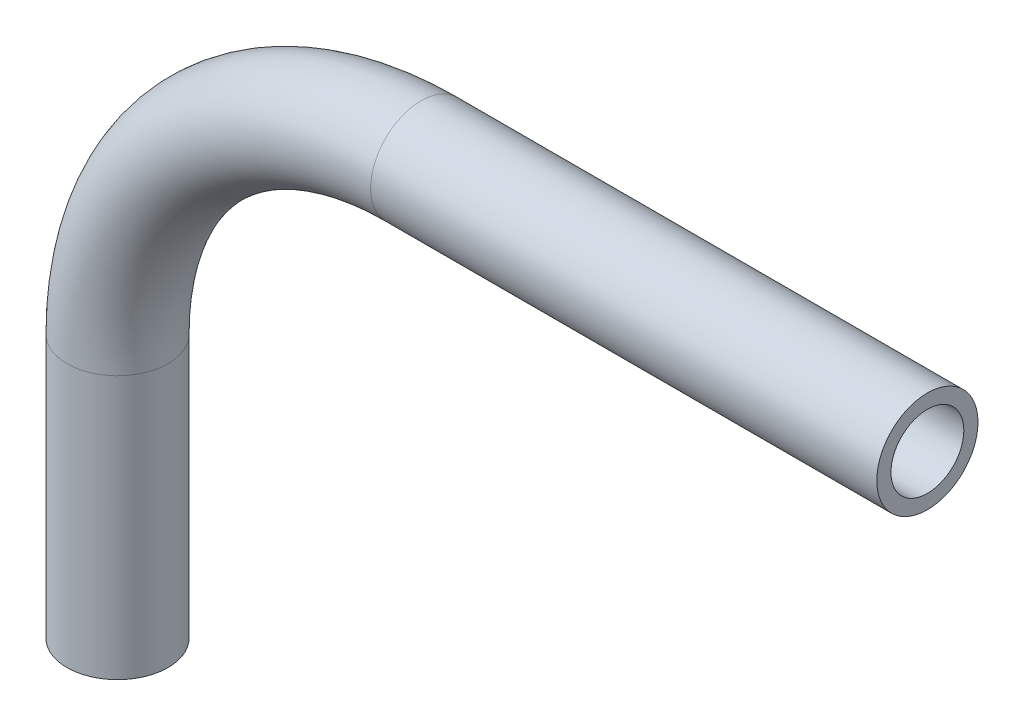
ISO-10303-21;
HEADER;
FILE_DESCRIPTION(('STEP AP214'),'2;1');
FILE_NAME('part.step','',(''),(''),'','','');
FILE_SCHEMA(('AUTOMOTIVE_DESIGN { 1 0 10303 214 1 1 1 1 }'));
ENDSEC;
DATA;
#1=APPLICATION_CONTEXT('core data for automotive mechanical design processes');
#2=APPLICATION_PROTOCOL_DEFINITION('international standard','automotive_design',2000,#1);
#3=PRODUCT_CONTEXT('',#1,'mechanical');
#4=PRODUCT('Part','Part','',(#3));
#5=PRODUCT_RELATED_PRODUCT_CATEGORY('part','',(#4));
#6=PRODUCT_DEFINITION_FORMATION('','',#4);
#7=PRODUCT_DEFINITION_CONTEXT('part definition',#1,'design');
#8=PRODUCT_DEFINITION('design','',#6,#7);
#9=PRODUCT_DEFINITION_SHAPE('','',#8);
#10=(LENGTH_UNIT() NAMED_UNIT(*) SI_UNIT(.MILLI.,.METRE.));
#11=(NAMED_UNIT(*) PLANE_ANGLE_UNIT() SI_UNIT($,.RADIAN.));
#12=(NAMED_UNIT(*) SI_UNIT($,.STERADIAN.) SOLID_ANGLE_UNIT());
#13=UNCERTAINTY_MEASURE_WITH_UNIT(LENGTH_MEASURE(1.E-05),#10,'distance_accuracy_value','');
#14=(GEOMETRIC_REPRESENTATION_CONTEXT(3) GLOBAL_UNCERTAINTY_ASSIGNED_CONTEXT((#13)) GLOBAL_UNIT_ASSIGNED_CONTEXT((#10,
#11,#12)) REPRESENTATION_CONTEXT('',''));
#15=CARTESIAN_POINT('',(0.,0.,0.));
#16=DIRECTION('',(0.,0.,1.));
#17=DIRECTION('',(1.,0.,0.));
#18=AXIS2_PLACEMENT_3D('',#15,#16,#17);
#19=CARTESIAN_POINT('',(0.,-18.0323178807947,0.));
#20=DIRECTION('',(0.,1.,0.));
#21=DIRECTION('',(0.,0.,1.));
#22=AXIS2_PLACEMENT_3D('',#19,#20,#21);
#23=CYLINDRICAL_SURFACE('',#22,3.175);
#24=CARTESIAN_POINT('',(0.,-1.52231788079484,0.));
#25=DIRECTION('',(0.,1.,0.));
#26=DIRECTION('',(0.,0.,-1.));
#27=AXIS2_PLACEMENT_3D('',#24,#25,#26);
#28=CIRCLE('',#27,3.175);
#29=CARTESIAN_POINT('',(-3.175,-1.52231788079487,0.));
#30=VERTEX_POINT('',#29);
#31=EDGE_CURVE('E80',#30,#30,#28,.T.);
#32=ORIENTED_EDGE('',*,*,#31,.F.);
#33=EDGE_LOOP('',(#32));
#34=FACE_BOUND('',#33,.T.);
#35=CARTESIAN_POINT('',(0.,-18.0323178807947,0.));
#36=DIRECTION('',(0.,1.,0.));
#37=DIRECTION('',(0.,0.,-1.));
#38=AXIS2_PLACEMENT_3D('',#35,#36,#37);
#39=CIRCLE('',#38,3.175);
#40=CARTESIAN_POINT('',(0.,-18.0323178807947,-3.175));
#41=VERTEX_POINT('',#40);
#42=EDGE_CURVE('E49',#41,#41,#39,.T.);
#43=ORIENTED_EDGE('',*,*,#42,.T.);
#44=EDGE_LOOP('',(#43));
#45=FACE_BOUND('',#44,.T.);
#46=ADVANCED_FACE('F34',(#34,#45),#23,.T.);
#47=CARTESIAN_POINT('',(19.05,-1.52231788079469,0.));
#48=DIRECTION('',(0.,0.,-1.));
#49=DIRECTION('',(-1.,0.,0.));
#50=AXIS2_PLACEMENT_3D('',#47,#48,#49);
#51=TOROIDAL_SURFACE('',#50,19.05,3.175);
#52=CARTESIAN_POINT('',(19.05,17.5276821192057,0.));
#53=DIRECTION('',(1.,0.,0.));
#54=DIRECTION('',(0.,0.,-1.));
#55=AXIS2_PLACEMENT_3D('',#52,#53,#54);
#56=CIRCLE('',#55,3.175);
#57=CARTESIAN_POINT('',(19.05,20.7026821192053,0.));
#58=VERTEX_POINT('',#57);
#59=EDGE_CURVE('E38',#58,#58,#56,.T.);
#60=CARTESIAN_POINT('',(19.05,-1.52231788079469,0.));
#61=DIRECTION('',(0.,0.,-1.));
#62=DIRECTION('',(-1.,0.,0.));
#63=AXIS2_PLACEMENT_3D('',#60,#61,#62);
#64=CIRCLE('',#63,22.225);
#65=EDGE_CURVE('',#30,#58,#64,.T.);
#66=ORIENTED_EDGE('',*,*,#31,.T.);
#67=ORIENTED_EDGE('',*,*,#59,.F.);
#68=ORIENTED_EDGE('',*,*,#65,.T.);
#69=ORIENTED_EDGE('',*,*,#65,.F.);
#70=EDGE_LOOP('',(#66,#68,#67,#69));
#71=FACE_BOUND('',#70,.T.);
#72=ADVANCED_FACE('F88',(#71),#51,.T.);
#73=CARTESIAN_POINT('',(19.0500000000001,17.5276821192053,0.));
#74=DIRECTION('',(1.,0.,0.));
#75=DIRECTION('',(0.,1.,0.));
#76=AXIS2_PLACEMENT_3D('',#73,#74,#75);
#77=CYLINDRICAL_SURFACE('',#76,3.175);
#78=CARTESIAN_POINT('',(50.8,17.5276821192053,0.));
#79=DIRECTION('',(1.,0.,0.));
#80=DIRECTION('',(0.,0.,-1.));
#81=AXIS2_PLACEMENT_3D('',#78,#79,#80);
#82=CIRCLE('',#81,3.175);
#83=CARTESIAN_POINT('',(50.8,17.5276821192053,-3.175));
#84=VERTEX_POINT('',#83);
#85=EDGE_CURVE('E54',#84,#84,#82,.T.);
#86=ORIENTED_EDGE('',*,*,#85,.F.);
#87=EDGE_LOOP('',(#86));
#88=FACE_BOUND('',#87,.T.);
#89=ORIENTED_EDGE('',*,*,#59,.T.);
#90=EDGE_LOOP('',(#89));
#91=FACE_BOUND('',#90,.T.);
#92=ADVANCED_FACE('F36',(#88,#91),#77,.T.);
#93=CARTESIAN_POINT('',(0.,-18.0323178807947,0.));
#94=DIRECTION('',(0.,1.,0.));
#95=DIRECTION('',(0.,0.,-1.));
#96=AXIS2_PLACEMENT_3D('',#93,#94,#95);
#97=PLANE('',#96);
#98=CARTESIAN_POINT('',(0.,-18.0323178807947,0.));
#99=DIRECTION('',(0.,1.,0.));
#100=DIRECTION('',(0.,0.,-1.));
#101=AXIS2_PLACEMENT_3D('',#98,#99,#100);
#102=CIRCLE('',#101,2.286);
#103=CARTESIAN_POINT('',(0.,-18.0323178807947,-2.286));
#104=VERTEX_POINT('',#103);
#105=EDGE_CURVE('E75',#104,#104,#102,.F.);
#106=ORIENTED_EDGE('',*,*,#105,.F.);
#107=EDGE_LOOP('',(#106));
#108=FACE_BOUND('',#107,.T.);
#109=ORIENTED_EDGE('',*,*,#42,.F.);
#110=EDGE_LOOP('',(#109));
#111=FACE_BOUND('',#110,.T.);
#112=ADVANCED_FACE('F94',(#108,#111),#97,.F.);
#113=CARTESIAN_POINT('',(50.8,17.5276821192053,0.));
#114=DIRECTION('',(1.,0.,0.));
#115=DIRECTION('',(0.,0.,-1.));
#116=AXIS2_PLACEMENT_3D('',#113,#114,#115);
#117=PLANE('',#116);
#118=CARTESIAN_POINT('',(50.8,17.5276821192053,0.));
#119=DIRECTION('',(1.,0.,0.));
#120=DIRECTION('',(0.,0.,-1.));
#121=AXIS2_PLACEMENT_3D('',#118,#119,#120);
#122=CIRCLE('',#121,2.286);
#123=CARTESIAN_POINT('',(50.8,17.5276821192053,-2.286));
#124=VERTEX_POINT('',#123);
#125=EDGE_CURVE('E11',#124,#124,#122,.F.);
#126=ORIENTED_EDGE('',*,*,#125,.T.);
#127=EDGE_LOOP('',(#126));
#128=FACE_BOUND('',#127,.T.);
#129=ORIENTED_EDGE('',*,*,#85,.T.);
#130=EDGE_LOOP('',(#129));
#131=FACE_BOUND('',#130,.T.);
#132=ADVANCED_FACE('F61',(#128,#131),#117,.T.);
#133=CARTESIAN_POINT('',(0.,-18.0323178807947,0.));
#134=DIRECTION('',(0.,1.,0.));
#135=DIRECTION('',(0.,0.,1.));
#136=AXIS2_PLACEMENT_3D('',#133,#134,#135);
#137=CYLINDRICAL_SURFACE('',#136,2.286);
#138=CARTESIAN_POINT('',(0.,-1.52231788079484,0.));
#139=DIRECTION('',(0.,1.,0.));
#140=DIRECTION('',(0.,0.,-1.));
#141=AXIS2_PLACEMENT_3D('',#138,#139,#140);
#142=CIRCLE('',#141,2.286);
#143=CARTESIAN_POINT('',(-2.286,-1.52231788079486,0.));
#144=VERTEX_POINT('',#143);
#145=EDGE_CURVE('E72',#144,#144,#142,.F.);
#146=ORIENTED_EDGE('',*,*,#145,.F.);
#147=EDGE_LOOP('',(#146));
#148=FACE_BOUND('',#147,.T.);
#149=ORIENTED_EDGE('',*,*,#105,.T.);
#150=EDGE_LOOP('',(#149));
#151=FACE_BOUND('',#150,.T.);
#152=ADVANCED_FACE('F102',(#148,#151),#137,.F.);
#153=CARTESIAN_POINT('',(19.05,-1.52231788079469,0.));
#154=DIRECTION('',(0.,0.,-1.));
#155=DIRECTION('',(-1.,0.,0.));
#156=AXIS2_PLACEMENT_3D('',#153,#154,#155);
#157=TOROIDAL_SURFACE('',#156,19.05,2.286);
#158=CARTESIAN_POINT('',(19.05,17.5276821192057,0.));
#159=DIRECTION('',(1.,0.,0.));
#160=DIRECTION('',(0.,0.,-1.));
#161=AXIS2_PLACEMENT_3D('',#158,#159,#160);
#162=CIRCLE('',#161,2.286);
#163=CARTESIAN_POINT('',(19.05,19.8136821192053,0.));
#164=VERTEX_POINT('',#163);
#165=EDGE_CURVE('E43',#164,#164,#162,.F.);
#166=CARTESIAN_POINT('',(19.05,-1.52231788079469,0.));
#167=DIRECTION('',(0.,0.,-1.));
#168=DIRECTION('',(-1.,0.,0.));
#169=AXIS2_PLACEMENT_3D('',#166,#167,#168);
#170=CIRCLE('',#169,21.336);
#171=EDGE_CURVE('',#144,#164,#170,.T.);
#172=ORIENTED_EDGE('',*,*,#145,.T.);
#173=ORIENTED_EDGE('',*,*,#165,.F.);
#174=ORIENTED_EDGE('',*,*,#171,.T.);
#175=ORIENTED_EDGE('',*,*,#171,.F.);
#176=EDGE_LOOP('',(#172,#174,#173,#175));
#177=FACE_BOUND('',#176,.T.);
#178=ADVANCED_FACE('F67',(#177),#157,.F.);
#179=CARTESIAN_POINT('',(19.0500000000001,17.5276821192053,0.));
#180=DIRECTION('',(1.,0.,0.));
#181=DIRECTION('',(0.,1.,0.));
#182=AXIS2_PLACEMENT_3D('',#179,#180,#181);
#183=CYLINDRICAL_SURFACE('',#182,2.286);
#184=ORIENTED_EDGE('',*,*,#125,.F.);
#185=EDGE_LOOP('',(#184));
#186=FACE_BOUND('',#185,.T.);
#187=ORIENTED_EDGE('',*,*,#165,.T.);
#188=EDGE_LOOP('',(#187));
#189=FACE_BOUND('',#188,.T.);
#190=ADVANCED_FACE('F64',(#186,#189),#183,.F.);
#191=CLOSED_SHELL('',(#46,#72,#92,#112,#132,#152,#178,#190));
#192=MANIFOLD_SOLID_BREP('B2',#191);
#193=ADVANCED_BREP_SHAPE_REPRESENTATION('',(#18,#192),#14);
#194=SHAPE_DEFINITION_REPRESENTATION(#9,#193);
ENDSEC;
END-ISO-10303-21;
